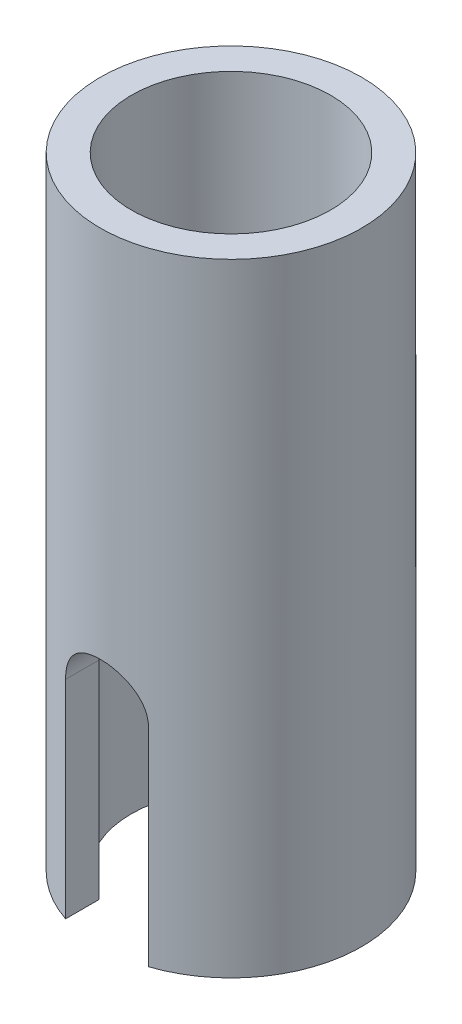
ISO-10303-21;
HEADER;
FILE_DESCRIPTION(('STEP AP214'),'2;1');
FILE_NAME('part.step','',(''),(''),'','','');
FILE_SCHEMA(('AUTOMOTIVE_DESIGN { 1 0 10303 214 1 1 1 1 }'));
ENDSEC;
DATA;
#1=APPLICATION_CONTEXT('core data for automotive mechanical design processes');
#2=APPLICATION_PROTOCOL_DEFINITION('international standard','automotive_design',2000,#1);
#3=PRODUCT_CONTEXT('',#1,'mechanical');
#4=PRODUCT('Part','Part','',(#3));
#5=PRODUCT_RELATED_PRODUCT_CATEGORY('part','',(#4));
#6=PRODUCT_DEFINITION_FORMATION('','',#4);
#7=PRODUCT_DEFINITION_CONTEXT('part definition',#1,'design');
#8=PRODUCT_DEFINITION('design','',#6,#7);
#9=PRODUCT_DEFINITION_SHAPE('','',#8);
#10=(LENGTH_UNIT() NAMED_UNIT(*) SI_UNIT(.MILLI.,.METRE.));
#11=(NAMED_UNIT(*) PLANE_ANGLE_UNIT() SI_UNIT($,.RADIAN.));
#12=(NAMED_UNIT(*) SI_UNIT($,.STERADIAN.) SOLID_ANGLE_UNIT());
#13=UNCERTAINTY_MEASURE_WITH_UNIT(LENGTH_MEASURE(1.E-05),#10,'distance_accuracy_value','');
#14=(GEOMETRIC_REPRESENTATION_CONTEXT(3) GLOBAL_UNCERTAINTY_ASSIGNED_CONTEXT((#13)) GLOBAL_UNIT_ASSIGNED_CONTEXT((#10,
#11,#12)) REPRESENTATION_CONTEXT('',''));
#15=CARTESIAN_POINT('',(0.,0.,0.));
#16=DIRECTION('',(0.,0.,1.));
#17=DIRECTION('',(1.,0.,0.));
#18=AXIS2_PLACEMENT_3D('',#15,#16,#17);
#19=CARTESIAN_POINT('',(4.8,0.,0.));
#20=DIRECTION('',(0.,-1.,0.));
#21=DIRECTION('',(0.,0.,-1.));
#22=AXIS2_PLACEMENT_3D('',#19,#20,#21);
#23=PLANE('',#22);
#24=DIRECTION('',(0.,0.,-1.));
#25=VECTOR('',#24,1.);
#26=CARTESIAN_POINT('',(-2.,0.,0.));
#27=LINE('',#26,#25);
#28=CARTESIAN_POINT('',(-2.,0.,5.97411081249754));
#29=VERTEX_POINT('',#28);
#30=CARTESIAN_POINT('',(-2.,0.,4.36348484585428));
#31=VERTEX_POINT('',#30);
#32=EDGE_CURVE('E133',#29,#31,#27,.T.);
#33=ORIENTED_EDGE('',*,*,#32,.F.);
#34=CARTESIAN_POINT('',(0.,0.,0.));
#35=DIRECTION('',(0.,-1.,0.));
#36=DIRECTION('',(0.,0.,-1.));
#37=AXIS2_PLACEMENT_3D('',#34,#35,#36);
#38=CIRCLE('',#37,6.3);
#39=CARTESIAN_POINT('',(-2.,0.,-5.97411081249754));
#40=VERTEX_POINT('',#39);
#41=EDGE_CURVE('E195',#29,#40,#38,.T.);
#42=ORIENTED_EDGE('',*,*,#41,.T.);
#43=CARTESIAN_POINT('',(-2.,0.,-4.36348484585428));
#44=VERTEX_POINT('',#43);
#45=EDGE_CURVE('E199',#44,#40,#27,.T.);
#46=ORIENTED_EDGE('',*,*,#45,.F.);
#47=CARTESIAN_POINT('',(0.,0.,0.));
#48=DIRECTION('',(0.,-1.,0.));
#49=DIRECTION('',(0.,0.,-1.));
#50=AXIS2_PLACEMENT_3D('',#47,#48,#49);
#51=CIRCLE('',#50,4.8);
#52=EDGE_CURVE('E196',#31,#44,#51,.T.);
#53=ORIENTED_EDGE('',*,*,#52,.F.);
#54=EDGE_LOOP('',(#33,#42,#46,#53));
#55=FACE_BOUND('',#54,.T.);
#56=ADVANCED_FACE('F41',(#55),#23,.T.);
#57=CARTESIAN_POINT('',(0.,0.,0.));
#58=DIRECTION('',(0.,-1.,0.));
#59=DIRECTION('',(0.,0.,-1.));
#60=AXIS2_PLACEMENT_3D('',#57,#58,#59);
#61=CYLINDRICAL_SURFACE('',#60,4.8);
#62=DIRECTION('',(0.,-1.,0.));
#63=VECTOR('',#62,1.);
#64=CARTESIAN_POINT('',(-2.,0.,4.36348484585428));
#65=LINE('',#64,#63);
#66=CARTESIAN_POINT('',(-2.,10.,4.36348484585428));
#67=VERTEX_POINT('',#66);
#68=EDGE_CURVE('E198',#31,#67,#65,.F.);
#69=ORIENTED_EDGE('',*,*,#68,.F.);
#70=ORIENTED_EDGE('',*,*,#52,.T.);
#71=DIRECTION('',(0.,-1.,0.));
#72=VECTOR('',#71,1.);
#73=CARTESIAN_POINT('',(-2.,0.,-4.36348484585428));
#74=LINE('',#73,#72);
#75=CARTESIAN_POINT('',(-2.,10.,-4.36348484585428));
#76=VERTEX_POINT('',#75);
#77=EDGE_CURVE('E129',#76,#44,#74,.T.);
#78=ORIENTED_EDGE('',*,*,#77,.F.);
#79=CARTESIAN_POINT('',(2.,10.,-4.36348484585428));
#80=CARTESIAN_POINT('',(2.00000819972645,10.0535923371176,-4.36347314938192));
#81=CARTESIAN_POINT('',(1.99784612859565,10.1071782860857,-4.36447189138492));
#82=CARTESIAN_POINT('',(1.98924559473605,10.2139129740848,-4.36840275546553));
#83=CARTESIAN_POINT('',(1.9828089004302,10.2670618847183,-4.37133407802581));
#84=CARTESIAN_POINT('',(1.96575906045681,10.3723214878971,-4.37902654889413));
#85=CARTESIAN_POINT('',(1.95516357297458,10.4244356039077,-4.38377995867097));
#86=CARTESIAN_POINT('',(1.92991818445083,10.5274781204565,-4.39495228132534));
#87=CARTESIAN_POINT('',(1.91526800583602,10.5784064395593,-4.40137130822467));
#88=CARTESIAN_POINT('',(1.86547604202997,10.7287763813513,-4.42281773487228));
#89=CARTESIAN_POINT('',(1.82445579172605,10.8260279527359,-4.44005227566458));
#90=CARTESIAN_POINT('',(1.72807734181261,11.0123159759824,-4.47844021499472));
#91=CARTESIAN_POINT('',(1.67270419214242,11.101343729933,-4.49959769310555));
#92=CARTESIAN_POINT('',(1.54555373284197,11.2741244144237,-4.54489391626279));
#93=CARTESIAN_POINT('',(1.47303305418077,11.3573051710068,-4.56913316521806));
#94=CARTESIAN_POINT('',(1.31521978601312,11.5107335495753,-4.61703285327609));
#95=CARTESIAN_POINT('',(1.22992446809132,11.5809784015388,-4.64069316747065));
#96=CARTESIAN_POINT('',(1.04442129935287,11.7095190631809,-4.68600863688963));
#97=CARTESIAN_POINT('',(0.943726411353131,11.767162790162,-4.7075319362902));
#98=CARTESIAN_POINT('',(0.733010679842922,11.8644419158436,-4.74490440335218));
#99=CARTESIAN_POINT('',(0.622994047168596,11.9040853947303,-4.76075611627044));
#100=CARTESIAN_POINT('',(0.402830570329408,11.9621428568377,-4.78428023196875));
#101=CARTESIAN_POINT('',(0.292988509346678,11.9815543568107,-4.79233539321838));
#102=CARTESIAN_POINT('',(0.0713287085290441,12.0018202143128,-4.80074925037221));
#103=CARTESIAN_POINT('',(-0.0404882486282973,12.002681765295,-4.80111092971802));
#104=CARTESIAN_POINT('',(-0.255669362146981,11.9863450813102,-4.79432203729086));
#105=CARTESIAN_POINT('',(-0.359133796377716,11.9702427610119,-4.78762731617037));
#106=CARTESIAN_POINT('',(-0.561734370835178,11.9223144728702,-4.76810404359556));
#107=CARTESIAN_POINT('',(-0.660870267320352,11.8904876208123,-4.75527514720844));
#108=CARTESIAN_POINT('',(-0.853820454584056,11.8116353730705,-4.72447772355591));
#109=CARTESIAN_POINT('',(-0.947530450656163,11.7643854565565,-4.70643375212425));
#110=CARTESIAN_POINT('',(-1.12593790985779,11.6562473744247,-4.66697165729274));
#111=CARTESIAN_POINT('',(-1.21063207320821,11.5953542405564,-4.64555230557517));
#112=CARTESIAN_POINT('',(-1.37494030245803,11.456672773166,-4.59970861221721));
#113=CARTESIAN_POINT('',(-1.45377666362612,11.3779966629934,-4.57517887722411));
#114=CARTESIAN_POINT('',(-1.59748250818258,11.2084714828601,-4.5270086334648));
#115=CARTESIAN_POINT('',(-1.66234490795389,11.1176162768043,-4.50336858067978));
#116=CARTESIAN_POINT('',(-1.77827611606724,10.9225162798764,-4.45889295209974));
#117=CARTESIAN_POINT('',(-1.82881203365073,10.8179257012209,-4.43817737587371));
#118=CARTESIAN_POINT('',(-1.91118095346503,10.6006837012345,-4.40334129158343));
#119=CARTESIAN_POINT('',(-1.94304840938256,10.4880475624018,-4.38920864430011));
#120=CARTESIAN_POINT('',(-1.97652421230322,10.3118793252738,-4.37418630360844));
#121=CARTESIAN_POINT('',(-1.98531279370341,10.2498951465707,-4.37019442404851));
#122=CARTESIAN_POINT('',(-1.99705305006963,10.1252878549284,-4.36483633170117));
#123=CARTESIAN_POINT('',(-2.00000680942441,10.0626649781915,-4.36346918127981));
#124=CARTESIAN_POINT('',(-2.,10.,-4.36348484585428));
#125=B_SPLINE_CURVE_WITH_KNOTS('',3,(#79,#80,#81,#82,#83,#84,#85,#86,#87,#88,#89,#90,#91,#92,
#93,#94,#95,#96,#97,#98,#99,#100,#101,#102,#103,#104,#105,#106,#107,#108,#109,#110,#111,#112,
#113,#114,#115,#116,#117,#118,#119,#120,#121,#122,#123,#124),.UNSPECIFIED.,.F.,.F.,(4,2,2,2,2,2,
2,2,2,2,2,2,2,2,2,2,2,2,2,2,2,2,4),(0.,0.160713501148005,0.321360556078378,0.481332758713569,
0.641315915326878,0.960604794823533,1.28022759328488,1.61769875638923,1.95524209985198,
2.30745696221062,2.65951356107819,2.99324718428381,3.32685138716377,3.64015267554912,
3.95347158335257,4.27157179268062,4.58978802871983,4.93041245174163,5.27120913837819,
5.62338517987782,5.97490919637184,6.16280699556659,6.35063765939092),.UNSPECIFIED.);
#126=CARTESIAN_POINT('',(2.,10.,-4.36348484585428));
#127=VERTEX_POINT('',#126);
#128=EDGE_CURVE('E118',#127,#76,#125,.T.);
#129=ORIENTED_EDGE('',*,*,#128,.F.);
#130=DIRECTION('',(0.,-1.,0.));
#131=VECTOR('',#130,1.);
#132=CARTESIAN_POINT('',(2.,0.,-4.36348484585428));
#133=LINE('',#132,#131);
#134=CARTESIAN_POINT('',(2.,0.,-4.36348484585429));
#135=VERTEX_POINT('',#134);
#136=EDGE_CURVE('E106',#135,#127,#133,.F.);
#137=ORIENTED_EDGE('',*,*,#136,.F.);
#138=CARTESIAN_POINT('',(2.,0.,4.36348484585429));
#139=VERTEX_POINT('',#138);
#140=EDGE_CURVE('E211',#135,#139,#51,.T.);
#141=ORIENTED_EDGE('',*,*,#140,.T.);
#142=DIRECTION('',(0.,-1.,0.));
#143=VECTOR('',#142,1.);
#144=CARTESIAN_POINT('',(2.,0.,4.36348484585428));
#145=LINE('',#144,#143);
#146=CARTESIAN_POINT('',(2.,10.,4.36348484585428));
#147=VERTEX_POINT('',#146);
#148=EDGE_CURVE('E131',#147,#139,#145,.T.);
#149=ORIENTED_EDGE('',*,*,#148,.F.);
#150=CARTESIAN_POINT('',(-2.,10.,4.36348484585428));
#151=CARTESIAN_POINT('',(-2.00000819972645,10.0535923371176,4.36347314938192));
#152=CARTESIAN_POINT('',(-1.99784612859565,10.1071782860857,4.36447189138492));
#153=CARTESIAN_POINT('',(-1.98924559473605,10.2139129740848,4.36840275546553));
#154=CARTESIAN_POINT('',(-1.9828089004302,10.2670618847183,4.37133407802581));
#155=CARTESIAN_POINT('',(-1.96575906045681,10.3723214878971,4.37902654889413));
#156=CARTESIAN_POINT('',(-1.95516357297458,10.4244356039077,4.38377995867097));
#157=CARTESIAN_POINT('',(-1.92991818445083,10.5274781204565,4.39495228132534));
#158=CARTESIAN_POINT('',(-1.91526800583602,10.5784064395593,4.40137130822467));
#159=CARTESIAN_POINT('',(-1.86547604202997,10.7287763813513,4.42281773487228));
#160=CARTESIAN_POINT('',(-1.82445579172605,10.8260279527359,4.44005227566458));
#161=CARTESIAN_POINT('',(-1.72807734181261,11.0123159759824,4.47844021499472));
#162=CARTESIAN_POINT('',(-1.67270419214242,11.101343729933,4.49959769310555));
#163=CARTESIAN_POINT('',(-1.54555373284197,11.2741244144237,4.54489391626279));
#164=CARTESIAN_POINT('',(-1.47303305418077,11.3573051710068,4.56913316521806));
#165=CARTESIAN_POINT('',(-1.31521978601312,11.5107335495753,4.61703285327609));
#166=CARTESIAN_POINT('',(-1.22992446809132,11.5809784015388,4.64069316747065));
#167=CARTESIAN_POINT('',(-1.04442129935287,11.7095190631809,4.68600863688963));
#168=CARTESIAN_POINT('',(-0.943726411353131,11.767162790162,4.7075319362902));
#169=CARTESIAN_POINT('',(-0.733010679842922,11.8644419158436,4.74490440335218));
#170=CARTESIAN_POINT('',(-0.622994047168596,11.9040853947303,4.76075611627044));
#171=CARTESIAN_POINT('',(-0.402830570329408,11.9621428568377,4.78428023196875));
#172=CARTESIAN_POINT('',(-0.292988509346678,11.9815543568107,4.79233539321838));
#173=CARTESIAN_POINT('',(-0.0713287085290441,12.0018202143128,4.80074925037221));
#174=CARTESIAN_POINT('',(0.0404882486282973,12.002681765295,4.80111092971802));
#175=CARTESIAN_POINT('',(0.255669362146981,11.9863450813102,4.79432203729086));
#176=CARTESIAN_POINT('',(0.359133796377716,11.9702427610119,4.78762731617037));
#177=CARTESIAN_POINT('',(0.561734370835178,11.9223144728702,4.76810404359556));
#178=CARTESIAN_POINT('',(0.660870267320352,11.8904876208123,4.75527514720844));
#179=CARTESIAN_POINT('',(0.853820454584056,11.8116353730705,4.72447772355591));
#180=CARTESIAN_POINT('',(0.947530450656163,11.7643854565565,4.70643375212425));
#181=CARTESIAN_POINT('',(1.12593790985779,11.6562473744247,4.66697165729274));
#182=CARTESIAN_POINT('',(1.21063207320821,11.5953542405564,4.64555230557517));
#183=CARTESIAN_POINT('',(1.37494030245803,11.456672773166,4.59970861221721));
#184=CARTESIAN_POINT('',(1.45377666362612,11.3779966629934,4.57517887722411));
#185=CARTESIAN_POINT('',(1.59748250818258,11.2084714828601,4.5270086334648));
#186=CARTESIAN_POINT('',(1.66234490795389,11.1176162768043,4.50336858067978));
#187=CARTESIAN_POINT('',(1.77827611606724,10.9225162798764,4.45889295209974));
#188=CARTESIAN_POINT('',(1.82881203365073,10.8179257012209,4.43817737587371));
#189=CARTESIAN_POINT('',(1.91118095346503,10.6006837012345,4.40334129158343));
#190=CARTESIAN_POINT('',(1.94304840938256,10.4880475624018,4.38920864430011));
#191=CARTESIAN_POINT('',(1.97652421230322,10.3118793252738,4.37418630360844));
#192=CARTESIAN_POINT('',(1.98531279370341,10.2498951465707,4.37019442404851));
#193=CARTESIAN_POINT('',(1.99705305006963,10.1252878549284,4.36483633170117));
#194=CARTESIAN_POINT('',(2.00000680942441,10.0626649781915,4.36346918127981));
#195=CARTESIAN_POINT('',(2.,10.,4.36348484585428));
#196=B_SPLINE_CURVE_WITH_KNOTS('',3,(#150,#151,#152,#153,#154,#155,#156,#157,#158,#159,#160,
#161,#162,#163,#164,#165,#166,#167,#168,#169,#170,#171,#172,#173,#174,#175,#176,#177,#178,#179,
#180,#181,#182,#183,#184,#185,#186,#187,#188,#189,#190,#191,#192,#193,#194,#195),.UNSPECIFIED.,
.F.,.F.,(4,2,2,2,2,2,2,2,2,2,2,2,2,2,2,2,2,2,2,2,2,2,4),(0.,0.160713501148005,0.321360556078378,
0.481332758713569,0.641315915326878,0.960604794823533,1.28022759328488,1.61769875638923,
1.95524209985198,2.30745696221062,2.65951356107819,2.99324718428381,3.32685138716377,
3.64015267554912,3.95347158335257,4.27157179268062,4.58978802871983,4.93041245174163,
5.27120913837819,5.62338517987782,5.97490919637184,6.16280699556659,6.35063765939092),.UNSPECIFIED.);
#197=EDGE_CURVE('E130',#67,#147,#196,.T.);
#198=ORIENTED_EDGE('',*,*,#197,.F.);
#199=EDGE_LOOP('',(#69,#70,#78,#129,#137,#141,#149,#198));
#200=FACE_BOUND('',#199,.T.);
#201=CARTESIAN_POINT('',(0.,30.,0.));
#202=DIRECTION('',(0.,-1.,0.));
#203=DIRECTION('',(0.,0.,-1.));
#204=AXIS2_PLACEMENT_3D('',#201,#202,#203);
#205=CIRCLE('',#204,4.8);
#206=CARTESIAN_POINT('',(0.,30.,-4.8));
#207=VERTEX_POINT('',#206);
#208=EDGE_CURVE('E208',#207,#207,#205,.T.);
#209=ORIENTED_EDGE('',*,*,#208,.F.);
#210=EDGE_LOOP('',(#209));
#211=FACE_BOUND('',#210,.T.);
#212=ADVANCED_FACE('F43',(#200,#211),#61,.F.);
#213=DIRECTION('',(0.,0.,1.));
#214=VECTOR('',#213,1.);
#215=CARTESIAN_POINT('',(2.,0.,0.));
#216=LINE('',#215,#214);
#217=CARTESIAN_POINT('',(2.,0.,-5.97411081249754));
#218=VERTEX_POINT('',#217);
#219=EDGE_CURVE('E109',#218,#135,#216,.T.);
#220=ORIENTED_EDGE('',*,*,#219,.F.);
#221=CARTESIAN_POINT('',(2.,0.,5.97411081249754));
#222=VERTEX_POINT('',#221);
#223=EDGE_CURVE('E203',#218,#222,#38,.T.);
#224=ORIENTED_EDGE('',*,*,#223,.T.);
#225=EDGE_CURVE('E65',#139,#222,#216,.T.);
#226=ORIENTED_EDGE('',*,*,#225,.F.);
#227=ORIENTED_EDGE('',*,*,#140,.F.);
#228=EDGE_LOOP('',(#220,#224,#226,#227));
#229=FACE_BOUND('',#228,.T.);
#230=ADVANCED_FACE('F178',(#229),#23,.T.);
#231=CARTESIAN_POINT('',(0.,0.,0.));
#232=DIRECTION('',(0.,-1.,0.));
#233=DIRECTION('',(0.,0.,-1.));
#234=AXIS2_PLACEMENT_3D('',#231,#232,#233);
#235=CYLINDRICAL_SURFACE('',#234,6.3);
#236=DIRECTION('',(0.,-1.,0.));
#237=VECTOR('',#236,1.);
#238=CARTESIAN_POINT('',(-2.,0.,-5.97411081249754));
#239=LINE('',#238,#237);
#240=CARTESIAN_POINT('',(-2.,10.,-5.97411081249754));
#241=VERTEX_POINT('',#240);
#242=EDGE_CURVE('E11',#40,#241,#239,.F.);
#243=ORIENTED_EDGE('',*,*,#242,.F.);
#244=ORIENTED_EDGE('',*,*,#41,.F.);
#245=DIRECTION('',(0.,-1.,0.));
#246=VECTOR('',#245,1.);
#247=CARTESIAN_POINT('',(-2.,0.,5.97411081249754));
#248=LINE('',#247,#246);
#249=CARTESIAN_POINT('',(-2.,10.,5.97411081249754));
#250=VERTEX_POINT('',#249);
#251=EDGE_CURVE('E173',#250,#29,#248,.T.);
#252=ORIENTED_EDGE('',*,*,#251,.F.);
#253=CARTESIAN_POINT('',(2.,10.,5.97411081249754));
#254=CARTESIAN_POINT('',(2.00000132015036,10.0547402115747,5.97410575569331));
#255=CARTESIAN_POINT('',(1.99775118883213,10.1094526633198,5.97486413517603));
#256=CARTESIAN_POINT('',(1.98878560295563,10.2184564812974,5.97785624209849));
#257=CARTESIAN_POINT('',(1.982071254334,10.2727479484527,5.98008960413457));
#258=CARTESIAN_POINT('',(1.95535125474545,10.4340927903303,5.98890414900856));
#259=CARTESIAN_POINT('',(1.92876800692997,10.5400183646577,5.99760053512905));
#260=CARTESIAN_POINT('',(1.85899930419869,10.7456016331645,6.0195879386755));
#261=CARTESIAN_POINT('',(1.81582136137992,10.845262139701,6.0328768768681));
#262=CARTESIAN_POINT('',(1.71416938102527,11.0360048161249,6.06254231180617));
#263=CARTESIAN_POINT('',(1.65568705967079,11.1270823038483,6.07892047931763));
#264=CARTESIAN_POINT('',(1.52288741778716,11.3012249837199,6.11356360699504));
#265=CARTESIAN_POINT('',(1.44812370268127,11.3839410219268,6.13187214278678));
#266=CARTESIAN_POINT('',(1.28583379550947,11.5359008229123,6.16794396969368));
#267=CARTESIAN_POINT('',(1.19830539517064,11.6051422497535,6.18570716582086));
#268=CARTESIAN_POINT('',(1.01043869935845,11.7297424701226,6.21918919458837));
#269=CARTESIAN_POINT('',(0.909848395173818,11.7847381340823,6.23485040189097));
#270=CARTESIAN_POINT('',(0.700267676718964,11.8768907711912,6.26185021271027));
#271=CARTESIAN_POINT('',(0.591279642253238,11.9140527767402,6.27319003547285));
#272=CARTESIAN_POINT('',(0.371669781497619,11.9683101319262,6.28996009577499));
#273=CARTESIAN_POINT('',(0.261209954286074,11.9860056730273,6.29556668870878));
#274=CARTESIAN_POINT('',(0.0387540449208004,12.0027311698696,6.30086223396746));
#275=CARTESIAN_POINT('',(-0.0732417029045344,12.0017651252589,6.30055245432027));
#276=CARTESIAN_POINT('',(-0.291356394401285,11.9815856695418,6.29417195338651));
#277=CARTESIAN_POINT('',(-0.397542568646931,11.9630234791394,6.28830683740135));
#278=CARTESIAN_POINT('',(-0.605204986553192,11.9092494116682,6.27172888477481));
#279=CARTESIAN_POINT('',(-0.706680974458878,11.8740366316602,6.26101578523507));
#280=CARTESIAN_POINT('',(-0.903528836114717,11.7875513051144,6.23567282077788));
#281=CARTESIAN_POINT('',(-0.998808766160718,11.7360838884013,6.22099576033967));
#282=CARTESIAN_POINT('',(-1.17957906939323,11.6187076760609,6.18926718800777));
#283=CARTESIAN_POINT('',(-1.2650669915823,11.5527952767446,6.17221508398324));
#284=CARTESIAN_POINT('',(-1.42770120623494,11.4050790572021,6.13668463211143));
#285=CARTESIAN_POINT('',(-1.50433306768222,11.3227152959077,6.11817647952629));
#286=CARTESIAN_POINT('',(-1.64286746334267,11.1461161720506,6.08244353901844));
#287=CARTESIAN_POINT('',(-1.70476549312231,11.0518771924232,6.06521914466952));
#288=CARTESIAN_POINT('',(-1.81270888302682,10.8526899605978,6.0338458927027));
#289=CARTESIAN_POINT('',(-1.85854862576442,10.7476236315213,6.01973772485069));
#290=CARTESIAN_POINT('',(-1.93166663826662,10.5307614344917,5.99667888632197));
#291=CARTESIAN_POINT('',(-1.95897371775724,10.4189763070452,5.98772021389374));
#292=CARTESIAN_POINT('',(-1.98432702626344,10.2551009305356,5.97933947322949));
#293=CARTESIAN_POINT('',(-1.99020285919255,10.2042436899988,5.9773836578468));
#294=CARTESIAN_POINT('',(-1.9980362933639,10.1022664704064,5.97476880428299));
#295=CARTESIAN_POINT('',(-1.99999932581362,10.0511469544269,5.974107968612));
#296=CARTESIAN_POINT('',(-2.,10.,5.97411081249754));
#297=B_SPLINE_CURVE_WITH_KNOTS('',3,(#253,#254,#255,#256,#257,#258,#259,#260,#261,#262,#263,
#264,#265,#266,#267,#268,#269,#270,#271,#272,#273,#274,#275,#276,#277,#278,#279,#280,#281,#282,
#283,#284,#285,#286,#287,#288,#289,#290,#291,#292,#293,#294,#295,#296),.UNSPECIFIED.,.F.,.F.,(4,
2,2,2,2,2,2,2,2,2,2,2,2,2,2,2,2,2,2,2,2,4),(0.,0.1641148910907,0.328189140549511,
0.655148368152224,0.981959761643191,1.30894841591224,1.64638882449772,1.98388767921066,
2.3292911438007,2.67459708314264,3.00892909069316,3.3431894432627,3.66554300760964,
3.98791405476835,4.31430677839349,4.64078102233477,4.98124522699529,5.32181338522166,
5.66659532012642,6.01084004320369,6.16439826438349,6.31774318846978),.UNSPECIFIED.);
#298=CARTESIAN_POINT('',(2.,10.,5.97411081249754));
#299=VERTEX_POINT('',#298);
#300=EDGE_CURVE('E157',#299,#250,#297,.T.);
#301=ORIENTED_EDGE('',*,*,#300,.F.);
#302=DIRECTION('',(0.,-1.,0.));
#303=VECTOR('',#302,1.);
#304=CARTESIAN_POINT('',(2.,0.,5.97411081249754));
#305=LINE('',#304,#303);
#306=EDGE_CURVE('E50',#222,#299,#305,.F.);
#307=ORIENTED_EDGE('',*,*,#306,.F.);
#308=ORIENTED_EDGE('',*,*,#223,.F.);
#309=DIRECTION('',(0.,-1.,0.));
#310=VECTOR('',#309,1.);
#311=CARTESIAN_POINT('',(2.,0.,-5.97411081249754));
#312=LINE('',#311,#310);
#313=CARTESIAN_POINT('',(2.,10.,-5.97411081249754));
#314=VERTEX_POINT('',#313);
#315=EDGE_CURVE('E172',#314,#218,#312,.T.);
#316=ORIENTED_EDGE('',*,*,#315,.F.);
#317=CARTESIAN_POINT('',(-2.,10.,-5.97411081249754));
#318=CARTESIAN_POINT('',(-2.00000132015036,10.0547402115747,-5.97410575569331));
#319=CARTESIAN_POINT('',(-1.99775118883213,10.1094526633198,-5.97486413517603));
#320=CARTESIAN_POINT('',(-1.98878560295563,10.2184564812974,-5.97785624209849));
#321=CARTESIAN_POINT('',(-1.982071254334,10.2727479484527,-5.98008960413457));
#322=CARTESIAN_POINT('',(-1.95535125474545,10.4340927903303,-5.98890414900856));
#323=CARTESIAN_POINT('',(-1.92876800692997,10.5400183646577,-5.99760053512905));
#324=CARTESIAN_POINT('',(-1.85899930419869,10.7456016331645,-6.0195879386755));
#325=CARTESIAN_POINT('',(-1.81582136137992,10.845262139701,-6.0328768768681));
#326=CARTESIAN_POINT('',(-1.71416938102527,11.0360048161249,-6.06254231180617));
#327=CARTESIAN_POINT('',(-1.65568705967079,11.1270823038483,-6.07892047931763));
#328=CARTESIAN_POINT('',(-1.52288741778716,11.3012249837199,-6.11356360699504));
#329=CARTESIAN_POINT('',(-1.44812370268127,11.3839410219268,-6.13187214278678));
#330=CARTESIAN_POINT('',(-1.28583379550947,11.5359008229123,-6.16794396969368));
#331=CARTESIAN_POINT('',(-1.19830539517064,11.6051422497535,-6.18570716582086));
#332=CARTESIAN_POINT('',(-1.01043869935845,11.7297424701226,-6.21918919458837));
#333=CARTESIAN_POINT('',(-0.909848395173818,11.7847381340823,-6.23485040189097));
#334=CARTESIAN_POINT('',(-0.700267676718964,11.8768907711912,-6.26185021271027));
#335=CARTESIAN_POINT('',(-0.591279642253238,11.9140527767402,-6.27319003547285));
#336=CARTESIAN_POINT('',(-0.371669781497619,11.9683101319262,-6.28996009577499));
#337=CARTESIAN_POINT('',(-0.261209954286074,11.9860056730273,-6.29556668870878));
#338=CARTESIAN_POINT('',(-0.0387540449208004,12.0027311698696,-6.30086223396746));
#339=CARTESIAN_POINT('',(0.0732417029045344,12.0017651252589,-6.30055245432027));
#340=CARTESIAN_POINT('',(0.291356394401285,11.9815856695418,-6.29417195338651));
#341=CARTESIAN_POINT('',(0.397542568646931,11.9630234791394,-6.28830683740135));
#342=CARTESIAN_POINT('',(0.605204986553192,11.9092494116682,-6.27172888477481));
#343=CARTESIAN_POINT('',(0.706680974458878,11.8740366316602,-6.26101578523507));
#344=CARTESIAN_POINT('',(0.903528836114717,11.7875513051144,-6.23567282077788));
#345=CARTESIAN_POINT('',(0.998808766160718,11.7360838884013,-6.22099576033967));
#346=CARTESIAN_POINT('',(1.17957906939323,11.6187076760609,-6.18926718800777));
#347=CARTESIAN_POINT('',(1.2650669915823,11.5527952767446,-6.17221508398324));
#348=CARTESIAN_POINT('',(1.42770120623494,11.4050790572021,-6.13668463211143));
#349=CARTESIAN_POINT('',(1.50433306768222,11.3227152959077,-6.11817647952629));
#350=CARTESIAN_POINT('',(1.64286746334267,11.1461161720506,-6.08244353901844));
#351=CARTESIAN_POINT('',(1.70476549312231,11.0518771924232,-6.06521914466952));
#352=CARTESIAN_POINT('',(1.81270888302682,10.8526899605978,-6.0338458927027));
#353=CARTESIAN_POINT('',(1.85854862576442,10.7476236315213,-6.01973772485069));
#354=CARTESIAN_POINT('',(1.93166663826662,10.5307614344917,-5.99667888632197));
#355=CARTESIAN_POINT('',(1.95897371775724,10.4189763070452,-5.98772021389374));
#356=CARTESIAN_POINT('',(1.98432702626344,10.2551009305356,-5.97933947322949));
#357=CARTESIAN_POINT('',(1.99020285919255,10.2042436899988,-5.9773836578468));
#358=CARTESIAN_POINT('',(1.9980362933639,10.1022664704064,-5.97476880428299));
#359=CARTESIAN_POINT('',(1.99999932581362,10.0511469544269,-5.974107968612));
#360=CARTESIAN_POINT('',(2.,10.,-5.97411081249754));
#361=B_SPLINE_CURVE_WITH_KNOTS('',3,(#317,#318,#319,#320,#321,#322,#323,#324,#325,#326,#327,
#328,#329,#330,#331,#332,#333,#334,#335,#336,#337,#338,#339,#340,#341,#342,#343,#344,#345,#346,
#347,#348,#349,#350,#351,#352,#353,#354,#355,#356,#357,#358,#359,#360),.UNSPECIFIED.,.F.,.F.,(4,
2,2,2,2,2,2,2,2,2,2,2,2,2,2,2,2,2,2,2,2,4),(0.,0.1641148910907,0.328189140549511,
0.655148368152224,0.981959761643191,1.30894841591224,1.64638882449772,1.98388767921066,
2.3292911438007,2.67459708314264,3.00892909069316,3.3431894432627,3.66554300760964,
3.98791405476835,4.31430677839349,4.64078102233477,4.98124522699529,5.32181338522166,
5.66659532012642,6.01084004320369,6.16439826438349,6.31774318846978),.UNSPECIFIED.);
#362=EDGE_CURVE('E120',#241,#314,#361,.T.);
#363=ORIENTED_EDGE('',*,*,#362,.F.);
#364=EDGE_LOOP('',(#243,#244,#252,#301,#307,#308,#316,#363));
#365=FACE_BOUND('',#364,.T.);
#366=CARTESIAN_POINT('',(0.,30.,0.));
#367=DIRECTION('',(0.,-1.,0.));
#368=DIRECTION('',(0.,0.,-1.));
#369=AXIS2_PLACEMENT_3D('',#366,#367,#368);
#370=CIRCLE('',#369,6.3);
#371=CARTESIAN_POINT('',(0.,30.,-6.3));
#372=VERTEX_POINT('',#371);
#373=EDGE_CURVE('E204',#372,#372,#370,.T.);
#374=ORIENTED_EDGE('',*,*,#373,.T.);
#375=EDGE_LOOP('',(#374));
#376=FACE_BOUND('',#375,.T.);
#377=ADVANCED_FACE('F174',(#365,#376),#235,.T.);
#378=CARTESIAN_POINT('',(6.3,30.,0.));
#379=DIRECTION('',(0.,1.,0.));
#380=DIRECTION('',(0.,0.,1.));
#381=AXIS2_PLACEMENT_3D('',#378,#379,#380);
#382=PLANE('',#381);
#383=ORIENTED_EDGE('',*,*,#208,.T.);
#384=EDGE_LOOP('',(#383));
#385=FACE_BOUND('',#384,.T.);
#386=ORIENTED_EDGE('',*,*,#373,.F.);
#387=EDGE_LOOP('',(#386));
#388=FACE_BOUND('',#387,.T.);
#389=ADVANCED_FACE('F177',(#385,#388),#382,.T.);
#390=CARTESIAN_POINT('',(2.,-10.,-6.3));
#391=DIRECTION('',(1.,0.,0.));
#392=DIRECTION('',(0.,1.,0.));
#393=AXIS2_PLACEMENT_3D('',#390,#391,#392);
#394=PLANE('',#393);
#395=ORIENTED_EDGE('',*,*,#136,.T.);
#396=DIRECTION('',(0.,0.,1.));
#397=VECTOR('',#396,1.);
#398=CARTESIAN_POINT('',(2.,10.,-6.3));
#399=LINE('',#398,#397);
#400=EDGE_CURVE('E57',#314,#127,#399,.T.);
#401=ORIENTED_EDGE('',*,*,#400,.F.);
#402=ORIENTED_EDGE('',*,*,#315,.T.);
#403=ORIENTED_EDGE('',*,*,#219,.T.);
#404=EDGE_LOOP('',(#395,#401,#402,#403));
#405=FACE_BOUND('',#404,.T.);
#406=ADVANCED_FACE('F107',(#405),#394,.F.);
#407=CARTESIAN_POINT('',(0.,10.,-6.3));
#408=DIRECTION('',(0.,0.,1.));
#409=DIRECTION('',(1.,0.,0.));
#410=AXIS2_PLACEMENT_3D('',#407,#408,#409);
#411=CYLINDRICAL_SURFACE('',#410,2.);
#412=ORIENTED_EDGE('',*,*,#128,.T.);
#413=DIRECTION('',(0.,0.,1.));
#414=VECTOR('',#413,1.);
#415=CARTESIAN_POINT('',(-2.,10.,-6.3));
#416=LINE('',#415,#414);
#417=EDGE_CURVE('E240',#241,#76,#416,.T.);
#418=ORIENTED_EDGE('',*,*,#417,.F.);
#419=ORIENTED_EDGE('',*,*,#362,.T.);
#420=ORIENTED_EDGE('',*,*,#400,.T.);
#421=EDGE_LOOP('',(#412,#418,#419,#420));
#422=FACE_BOUND('',#421,.T.);
#423=ADVANCED_FACE('F116',(#422),#411,.F.);
#424=CARTESIAN_POINT('',(-2.,-10.,-6.3));
#425=DIRECTION('',(-1.,0.,0.));
#426=DIRECTION('',(0.,-1.,0.));
#427=AXIS2_PLACEMENT_3D('',#424,#425,#426);
#428=PLANE('',#427);
#429=ORIENTED_EDGE('',*,*,#77,.T.);
#430=ORIENTED_EDGE('',*,*,#45,.T.);
#431=ORIENTED_EDGE('',*,*,#242,.T.);
#432=ORIENTED_EDGE('',*,*,#417,.T.);
#433=EDGE_LOOP('',(#429,#430,#431,#432));
#434=FACE_BOUND('',#433,.T.);
#435=ADVANCED_FACE('F150',(#434),#428,.F.);
#436=ORIENTED_EDGE('',*,*,#197,.T.);
#437=EDGE_CURVE('E123',#147,#299,#399,.T.);
#438=ORIENTED_EDGE('',*,*,#437,.T.);
#439=ORIENTED_EDGE('',*,*,#300,.T.);
#440=EDGE_CURVE('E122',#67,#250,#416,.T.);
#441=ORIENTED_EDGE('',*,*,#440,.F.);
#442=EDGE_LOOP('',(#436,#438,#439,#441));
#443=FACE_BOUND('',#442,.T.);
#444=ADVANCED_FACE('F151',(#443),#411,.F.);
#445=ORIENTED_EDGE('',*,*,#148,.T.);
#446=ORIENTED_EDGE('',*,*,#225,.T.);
#447=ORIENTED_EDGE('',*,*,#306,.T.);
#448=ORIENTED_EDGE('',*,*,#437,.F.);
#449=EDGE_LOOP('',(#445,#446,#447,#448));
#450=FACE_BOUND('',#449,.T.);
#451=ADVANCED_FACE('F227',(#450),#394,.F.);
#452=ORIENTED_EDGE('',*,*,#68,.T.);
#453=ORIENTED_EDGE('',*,*,#440,.T.);
#454=ORIENTED_EDGE('',*,*,#251,.T.);
#455=ORIENTED_EDGE('',*,*,#32,.T.);
#456=EDGE_LOOP('',(#452,#453,#454,#455));
#457=FACE_BOUND('',#456,.T.);
#458=ADVANCED_FACE('F152',(#457),#428,.F.);
#459=CLOSED_SHELL('',(#56,#212,#230,#377,#389,#406,#423,#435,#444,#451,#458));
#460=MANIFOLD_SOLID_BREP('B2',#459);
#461=ADVANCED_BREP_SHAPE_REPRESENTATION('',(#18,#460),#14);
#462=SHAPE_DEFINITION_REPRESENTATION(#9,#461);
ENDSEC;
END-ISO-10303-21;
